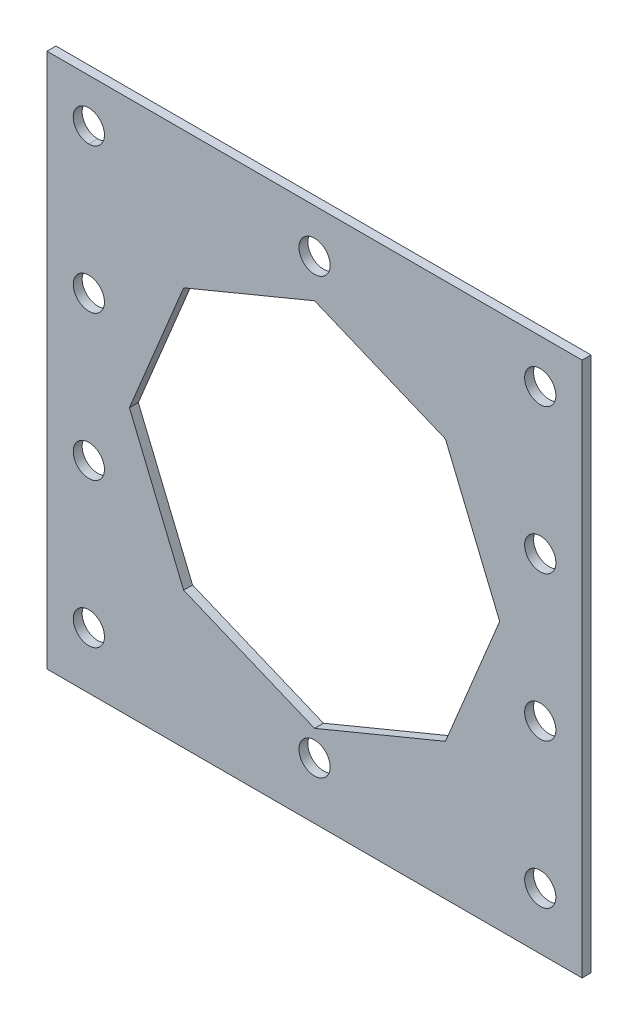
ISO-10303-21;
HEADER;
FILE_DESCRIPTION(('STEP AP214'),'2;1');
FILE_NAME('part.step','',(''),(''),'','','');
FILE_SCHEMA(('AUTOMOTIVE_DESIGN { 1 0 10303 214 1 1 1 1 }'));
ENDSEC;
DATA;
#1=APPLICATION_CONTEXT('core data for automotive mechanical design processes');
#2=APPLICATION_PROTOCOL_DEFINITION('international standard','automotive_design',2000,#1);
#3=PRODUCT_CONTEXT('',#1,'mechanical');
#4=PRODUCT('Part','Part','',(#3));
#5=PRODUCT_RELATED_PRODUCT_CATEGORY('part','',(#4));
#6=PRODUCT_DEFINITION_FORMATION('','',#4);
#7=PRODUCT_DEFINITION_CONTEXT('part definition',#1,'design');
#8=PRODUCT_DEFINITION('design','',#6,#7);
#9=PRODUCT_DEFINITION_SHAPE('','',#8);
#10=(LENGTH_UNIT() NAMED_UNIT(*) SI_UNIT(.MILLI.,.METRE.));
#11=(NAMED_UNIT(*) PLANE_ANGLE_UNIT() SI_UNIT($,.RADIAN.));
#12=(NAMED_UNIT(*) SI_UNIT($,.STERADIAN.) SOLID_ANGLE_UNIT());
#13=UNCERTAINTY_MEASURE_WITH_UNIT(LENGTH_MEASURE(1.E-05),#10,'distance_accuracy_value','');
#14=(GEOMETRIC_REPRESENTATION_CONTEXT(3) GLOBAL_UNCERTAINTY_ASSIGNED_CONTEXT((#13)) GLOBAL_UNIT_ASSIGNED_CONTEXT((#10,
#11,#12)) REPRESENTATION_CONTEXT('',''));
#15=CARTESIAN_POINT('',(0.,0.,0.));
#16=DIRECTION('',(0.,0.,1.));
#17=DIRECTION('',(1.,0.,0.));
#18=AXIS2_PLACEMENT_3D('',#15,#16,#17);
#19=CARTESIAN_POINT('',(-58.8904715737066,203.889838323353,10.));
#20=DIRECTION('',(0.,0.,-1.));
#21=DIRECTION('',(-1.,0.,0.));
#22=AXIS2_PLACEMENT_3D('',#19,#20,#21);
#23=CYLINDRICAL_SURFACE('',#22,17.5);
#24=CARTESIAN_POINT('',(-58.8904715737066,203.889838323353,0.));
#25=DIRECTION('',(0.,0.,1.));
#26=DIRECTION('',(1.,0.,0.));
#27=AXIS2_PLACEMENT_3D('',#24,#25,#26);
#28=CIRCLE('',#27,17.5);
#29=CARTESIAN_POINT('',(-58.892471573828,186.389838437639,0.));
#30=VERTEX_POINT('',#29);
#31=CARTESIAN_POINT('',(-58.892471573828,221.389838209068,0.));
#32=VERTEX_POINT('',#31);
#33=EDGE_CURVE('E264',#30,#32,#28,.T.);
#34=ORIENTED_EDGE('',*,*,#33,.F.);
#35=DIRECTION('',(0.,0.,-1.));
#36=VECTOR('',#35,1.);
#37=CARTESIAN_POINT('',(-58.892471573828,186.389838437639,10.));
#38=LINE('',#37,#36);
#39=CARTESIAN_POINT('',(-58.892471573828,186.389838437639,10.));
#40=VERTEX_POINT('',#39);
#41=EDGE_CURVE('E11',#40,#30,#38,.T.);
#42=ORIENTED_EDGE('',*,*,#41,.F.);
#43=CARTESIAN_POINT('',(-58.8904715737066,203.889838323353,10.));
#44=DIRECTION('',(0.,0.,1.));
#45=DIRECTION('',(1.,0.,0.));
#46=AXIS2_PLACEMENT_3D('',#43,#44,#45);
#47=CIRCLE('',#46,17.5);
#48=CARTESIAN_POINT('',(-58.892471573828,221.389838209068,10.));
#49=VERTEX_POINT('',#48);
#50=EDGE_CURVE('E200',#40,#49,#47,.T.);
#51=ORIENTED_EDGE('',*,*,#50,.T.);
#52=DIRECTION('',(0.,0.,-1.));
#53=VECTOR('',#52,1.);
#54=CARTESIAN_POINT('',(-58.892471573828,221.389838209068,10.));
#55=LINE('',#54,#53);
#56=EDGE_CURVE('E45',#49,#32,#55,.T.);
#57=ORIENTED_EDGE('',*,*,#56,.T.);
#58=EDGE_LOOP('',(#34,#42,#51,#57));
#59=FACE_BOUND('',#58,.T.);
#60=ADVANCED_FACE('F35',(#59),#23,.F.);
#61=CARTESIAN_POINT('',(494.179528426293,0.,10.));
#62=DIRECTION('',(1.,0.,0.));
#63=DIRECTION('',(0.,0.,-1.));
#64=AXIS2_PLACEMENT_3D('',#61,#62,#63);
#65=PLANE('',#64);
#66=DIRECTION('',(0.,-1.,0.));
#67=VECTOR('',#66,1.);
#68=CARTESIAN_POINT('',(494.179528426293,0.,0.));
#69=LINE('',#68,#67);
#70=CARTESIAN_POINT('',(494.179528426293,253.070838323353,0.));
#71=VERTEX_POINT('',#70);
#72=CARTESIAN_POINT('',(494.179528426293,-346.929161676647,0.));
#73=VERTEX_POINT('',#72);
#74=EDGE_CURVE('E234',#71,#73,#69,.T.);
#75=ORIENTED_EDGE('',*,*,#74,.F.);
#76=DIRECTION('',(0.,0.,-1.));
#77=VECTOR('',#76,1.);
#78=CARTESIAN_POINT('',(494.179528426293,253.070838323353,10.));
#79=LINE('',#78,#77);
#80=CARTESIAN_POINT('',(494.179528426293,253.070838323353,10.));
#81=VERTEX_POINT('',#80);
#82=EDGE_CURVE('E169',#81,#71,#79,.T.);
#83=ORIENTED_EDGE('',*,*,#82,.F.);
#84=DIRECTION('',(0.,-1.,0.));
#85=VECTOR('',#84,1.);
#86=CARTESIAN_POINT('',(494.179528426293,0.,10.));
#87=LINE('',#86,#85);
#88=CARTESIAN_POINT('',(494.179528426293,-346.929161676647,10.));
#89=VERTEX_POINT('',#88);
#90=EDGE_CURVE('E150',#81,#89,#87,.T.);
#91=ORIENTED_EDGE('',*,*,#90,.T.);
#92=DIRECTION('',(0.,0.,-1.));
#93=VECTOR('',#92,1.);
#94=CARTESIAN_POINT('',(494.179528426293,-346.929161676647,10.));
#95=LINE('',#94,#93);
#96=EDGE_CURVE('E160',#89,#73,#95,.T.);
#97=ORIENTED_EDGE('',*,*,#96,.T.);
#98=EDGE_LOOP('',(#75,#83,#91,#97));
#99=FACE_BOUND('',#98,.T.);
#100=ADVANCED_FACE('F168',(#99),#65,.T.);
#101=CARTESIAN_POINT('',(0.,253.070838323353,10.));
#102=DIRECTION('',(0.,1.,0.));
#103=DIRECTION('',(0.,0.,1.));
#104=AXIS2_PLACEMENT_3D('',#101,#102,#103);
#105=PLANE('',#104);
#106=DIRECTION('',(1.,0.,0.));
#107=VECTOR('',#106,1.);
#108=CARTESIAN_POINT('',(0.,253.070838323353,0.));
#109=LINE('',#108,#107);
#110=CARTESIAN_POINT('',(-105.820471573707,253.070838323353,0.));
#111=VERTEX_POINT('',#110);
#112=EDGE_CURVE('E236',#111,#71,#109,.T.);
#113=ORIENTED_EDGE('',*,*,#112,.F.);
#114=DIRECTION('',(0.,0.,-1.));
#115=VECTOR('',#114,1.);
#116=CARTESIAN_POINT('',(-105.820471573707,253.070838323353,10.));
#117=LINE('',#116,#115);
#118=CARTESIAN_POINT('',(-105.820471573707,253.070838323353,10.));
#119=VERTEX_POINT('',#118);
#120=EDGE_CURVE('E272',#119,#111,#117,.T.);
#121=ORIENTED_EDGE('',*,*,#120,.F.);
#122=DIRECTION('',(1.,0.,0.));
#123=VECTOR('',#122,1.);
#124=CARTESIAN_POINT('',(0.,253.070838323353,10.));
#125=LINE('',#124,#123);
#126=EDGE_CURVE('E170',#119,#81,#125,.T.);
#127=ORIENTED_EDGE('',*,*,#126,.T.);
#128=ORIENTED_EDGE('',*,*,#82,.T.);
#129=EDGE_LOOP('',(#113,#121,#127,#128));
#130=FACE_BOUND('',#129,.T.);
#131=ADVANCED_FACE('F363',(#130),#105,.T.);
#132=CARTESIAN_POINT('',(-105.820471573707,0.,10.));
#133=DIRECTION('',(1.,0.,0.));
#134=DIRECTION('',(0.,1.,0.));
#135=AXIS2_PLACEMENT_3D('',#132,#133,#134);
#136=PLANE('',#135);
#137=DIRECTION('',(0.,-1.,0.));
#138=VECTOR('',#137,1.);
#139=CARTESIAN_POINT('',(-105.820471573707,0.,0.));
#140=LINE('',#139,#138);
#141=CARTESIAN_POINT('',(-105.820471573707,-346.929161676647,0.));
#142=VERTEX_POINT('',#141);
#143=EDGE_CURVE('E239',#111,#142,#140,.T.);
#144=ORIENTED_EDGE('',*,*,#143,.T.);
#145=DIRECTION('',(0.,0.,-1.));
#146=VECTOR('',#145,1.);
#147=CARTESIAN_POINT('',(-105.820471573707,-346.929161676647,10.));
#148=LINE('',#147,#146);
#149=CARTESIAN_POINT('',(-105.820471573707,-346.929161676647,10.));
#150=VERTEX_POINT('',#149);
#151=EDGE_CURVE('E166',#150,#142,#148,.T.);
#152=ORIENTED_EDGE('',*,*,#151,.F.);
#153=DIRECTION('',(0.,-1.,0.));
#154=VECTOR('',#153,1.);
#155=CARTESIAN_POINT('',(-105.820471573707,0.,10.));
#156=LINE('',#155,#154);
#157=EDGE_CURVE('E153',#119,#150,#156,.T.);
#158=ORIENTED_EDGE('',*,*,#157,.F.);
#159=ORIENTED_EDGE('',*,*,#120,.T.);
#160=EDGE_LOOP('',(#144,#152,#158,#159));
#161=FACE_BOUND('',#160,.T.);
#162=ADVANCED_FACE('F396',(#161),#136,.F.);
#163=CARTESIAN_POINT('',(85.2344314709598,205.774120438351,10.));
#164=DIRECTION('',(-0.38268343236509,-0.923879532511287,0.));
#165=DIRECTION('',(0.923879532511287,-0.38268343236509,0.));
#166=AXIS2_PLACEMENT_3D('',#163,#164,#165);
#167=PLANE('',#166);
#168=DIRECTION('',(-0.923879532511287,0.38268343236509,0.));
#169=VECTOR('',#168,1.);
#170=CARTESIAN_POINT('',(85.2344314709598,205.774120438351,0.));
#171=LINE('',#170,#169);
#172=CARTESIAN_POINT('',(340.958452716714,99.849762613774,0.));
#173=VERTEX_POINT('',#172);
#174=CARTESIAN_POINT('',(194.179528426293,160.6475837254,0.));
#175=VERTEX_POINT('',#174);
#176=EDGE_CURVE('E210',#173,#175,#171,.T.);
#177=ORIENTED_EDGE('',*,*,#176,.F.);
#178=DIRECTION('',(0.,0.,-1.));
#179=VECTOR('',#178,1.);
#180=CARTESIAN_POINT('',(340.958452716714,99.849762613774,10.));
#181=LINE('',#180,#179);
#182=CARTESIAN_POINT('',(340.958452716714,99.849762613774,10.));
#183=VERTEX_POINT('',#182);
#184=EDGE_CURVE('E39',#183,#173,#181,.T.);
#185=ORIENTED_EDGE('',*,*,#184,.F.);
#186=DIRECTION('',(-0.923879532511287,0.38268343236509,0.));
#187=VECTOR('',#186,1.);
#188=CARTESIAN_POINT('',(85.2344314709598,205.774120438351,10.));
#189=LINE('',#188,#187);
#190=CARTESIAN_POINT('',(194.179528426293,160.6475837254,10.));
#191=VERTEX_POINT('',#190);
#192=EDGE_CURVE('E330',#183,#191,#189,.T.);
#193=ORIENTED_EDGE('',*,*,#192,.T.);
#194=DIRECTION('',(0.,0.,-1.));
#195=VECTOR('',#194,1.);
#196=CARTESIAN_POINT('',(194.179528426293,160.6475837254,10.));
#197=LINE('',#196,#195);
#198=EDGE_CURVE('E203',#191,#175,#197,.T.);
#199=ORIENTED_EDGE('',*,*,#198,.T.);
#200=EDGE_LOOP('',(#177,#185,#193,#199));
#201=FACE_BOUND('',#200,.T.);
#202=ADVANCED_FACE('F295',(#201),#167,.T.);
#203=CARTESIAN_POINT('',(326.328465489821,135.169676194284,10.));
#204=DIRECTION('',(-0.923879532511287,-0.38268343236509,0.));
#205=DIRECTION('',(0.38268343236509,-0.923879532511287,0.));
#206=AXIS2_PLACEMENT_3D('',#203,#204,#205);
#207=PLANE('',#206);
#208=DIRECTION('',(-0.38268343236509,0.923879532511287,0.));
#209=VECTOR('',#208,1.);
#210=CARTESIAN_POINT('',(326.328465489821,135.169676194284,0.));
#211=LINE('',#210,#209);
#212=CARTESIAN_POINT('',(401.75627382834,-46.9291616766467,0.));
#213=VERTEX_POINT('',#212);
#214=EDGE_CURVE('E213',#213,#173,#211,.T.);
#215=ORIENTED_EDGE('',*,*,#214,.F.);
#216=DIRECTION('',(0.,0.,-1.));
#217=VECTOR('',#216,1.);
#218=CARTESIAN_POINT('',(401.75627382834,-46.9291616766467,10.));
#219=LINE('',#218,#217);
#220=CARTESIAN_POINT('',(401.75627382834,-46.9291616766467,10.));
#221=VERTEX_POINT('',#220);
#222=EDGE_CURVE('E285',#221,#213,#219,.T.);
#223=ORIENTED_EDGE('',*,*,#222,.F.);
#224=DIRECTION('',(-0.38268343236509,0.923879532511287,0.));
#225=VECTOR('',#224,1.);
#226=CARTESIAN_POINT('',(326.328465489821,135.169676194284,10.));
#227=LINE('',#226,#225);
#228=EDGE_CURVE('E294',#221,#183,#227,.T.);
#229=ORIENTED_EDGE('',*,*,#228,.T.);
#230=ORIENTED_EDGE('',*,*,#184,.T.);
#231=EDGE_LOOP('',(#215,#223,#229,#230));
#232=FACE_BOUND('',#231,.T.);
#233=ADVANCED_FACE('F292',(#232),#207,.T.);
#234=CARTESIAN_POINT('',(359.512393946778,-148.914909413974,10.));
#235=DIRECTION('',(-0.923879532511287,0.38268343236509,0.));
#236=DIRECTION('',(-0.38268343236509,-0.923879532511287,0.));
#237=AXIS2_PLACEMENT_3D('',#234,#235,#236);
#238=PLANE('',#237);
#239=DIRECTION('',(0.38268343236509,0.923879532511287,0.));
#240=VECTOR('',#239,1.);
#241=CARTESIAN_POINT('',(359.512393946778,-148.914909413974,0.));
#242=LINE('',#241,#240);
#243=CARTESIAN_POINT('',(340.958452716714,-193.708085967068,0.));
#244=VERTEX_POINT('',#243);
#245=EDGE_CURVE('E216',#244,#213,#242,.T.);
#246=ORIENTED_EDGE('',*,*,#245,.F.);
#247=DIRECTION('',(0.,0.,-1.));
#248=VECTOR('',#247,1.);
#249=CARTESIAN_POINT('',(340.958452716714,-193.708085967068,10.));
#250=LINE('',#249,#248);
#251=CARTESIAN_POINT('',(340.958452716714,-193.708085967068,10.));
#252=VERTEX_POINT('',#251);
#253=EDGE_CURVE('E284',#252,#244,#250,.T.);
#254=ORIENTED_EDGE('',*,*,#253,.F.);
#255=DIRECTION('',(0.38268343236509,0.923879532511287,0.));
#256=VECTOR('',#255,1.);
#257=CARTESIAN_POINT('',(359.512393946778,-148.914909413974,10.));
#258=LINE('',#257,#256);
#259=EDGE_CURVE('E303',#252,#221,#258,.T.);
#260=ORIENTED_EDGE('',*,*,#259,.T.);
#261=ORIENTED_EDGE('',*,*,#222,.T.);
#262=EDGE_LOOP('',(#246,#254,#260,#261));
#263=FACE_BOUND('',#262,.T.);
#264=ADVANCED_FACE('F301',(#263),#238,.T.);
#265=CARTESIAN_POINT('',(118.418359927917,-285.887210571955,10.));
#266=DIRECTION('',(-0.38268343236509,0.923879532511287,0.));
#267=DIRECTION('',(-0.923879532511287,-0.38268343236509,0.));
#268=AXIS2_PLACEMENT_3D('',#265,#266,#267);
#269=PLANE('',#268);
#270=DIRECTION('',(0.923879532511287,0.38268343236509,0.));
#271=VECTOR('',#270,1.);
#272=CARTESIAN_POINT('',(118.418359927917,-285.887210571955,0.));
#273=LINE('',#272,#271);
#274=CARTESIAN_POINT('',(194.179528426294,-254.505907078694,0.));
#275=VERTEX_POINT('',#274);
#276=EDGE_CURVE('E219',#275,#244,#273,.T.);
#277=ORIENTED_EDGE('',*,*,#276,.F.);
#278=DIRECTION('',(0.,0.,-1.));
#279=VECTOR('',#278,1.);
#280=CARTESIAN_POINT('',(194.179528426294,-254.505907078694,10.));
#281=LINE('',#280,#279);
#282=CARTESIAN_POINT('',(194.179528426294,-254.505907078694,10.));
#283=VERTEX_POINT('',#282);
#284=EDGE_CURVE('E282',#283,#275,#281,.T.);
#285=ORIENTED_EDGE('',*,*,#284,.F.);
#286=DIRECTION('',(0.923879532511287,0.38268343236509,0.));
#287=VECTOR('',#286,1.);
#288=CARTESIAN_POINT('',(118.418359927917,-285.887210571955,10.));
#289=LINE('',#288,#287);
#290=EDGE_CURVE('E309',#283,#252,#289,.T.);
#291=ORIENTED_EDGE('',*,*,#290,.T.);
#292=ORIENTED_EDGE('',*,*,#253,.T.);
#293=EDGE_LOOP('',(#277,#285,#291,#292));
#294=FACE_BOUND('',#293,.T.);
#295=ADVANCED_FACE('F312',(#294),#269,.T.);
#296=CARTESIAN_POINT('',(-61.5444928194611,-148.581549254117,10.));
#297=DIRECTION('',(0.38268343236509,0.923879532511287,0.));
#298=DIRECTION('',(-0.923879532511287,0.38268343236509,0.));
#299=AXIS2_PLACEMENT_3D('',#296,#297,#298);
#300=PLANE('',#299);
#301=DIRECTION('',(0.923879532511287,-0.38268343236509,0.));
#302=VECTOR('',#301,1.);
#303=CARTESIAN_POINT('',(-61.5444928194611,-148.581549254117,0.));
#304=LINE('',#303,#302);
#305=CARTESIAN_POINT('',(47.4006041358727,-193.708085967068,0.));
#306=VERTEX_POINT('',#305);
#307=EDGE_CURVE('E222',#306,#275,#304,.T.);
#308=ORIENTED_EDGE('',*,*,#307,.F.);
#309=DIRECTION('',(0.,0.,-1.));
#310=VECTOR('',#309,1.);
#311=CARTESIAN_POINT('',(47.4006041358727,-193.708085967068,10.));
#312=LINE('',#311,#310);
#313=CARTESIAN_POINT('',(47.4006041358727,-193.708085967068,10.));
#314=VERTEX_POINT('',#313);
#315=EDGE_CURVE('E280',#314,#306,#312,.T.);
#316=ORIENTED_EDGE('',*,*,#315,.F.);
#317=DIRECTION('',(0.923879532511287,-0.38268343236509,0.));
#318=VECTOR('',#317,1.);
#319=CARTESIAN_POINT('',(-61.5444928194611,-148.581549254117,10.));
#320=LINE('',#319,#318);
#321=EDGE_CURVE('E313',#314,#283,#320,.T.);
#322=ORIENTED_EDGE('',*,*,#321,.T.);
#323=ORIENTED_EDGE('',*,*,#284,.T.);
#324=EDGE_LOOP('',(#308,#316,#322,#323));
#325=FACE_BOUND('',#324,.T.);
#326=ADVANCED_FACE('F410',(#325),#300,.T.);
#327=CARTESIAN_POINT('',(-28.0272042026464,-11.6092480961364,10.));
#328=DIRECTION('',(0.923879532511287,0.38268343236509,0.));
#329=DIRECTION('',(-0.38268343236509,0.923879532511287,0.));
#330=AXIS2_PLACEMENT_3D('',#327,#328,#329);
#331=PLANE('',#330);
#332=DIRECTION('',(0.38268343236509,-0.923879532511287,0.));
#333=VECTOR('',#332,1.);
#334=CARTESIAN_POINT('',(-28.0272042026464,-11.6092480961364,0.));
#335=LINE('',#334,#333);
#336=CARTESIAN_POINT('',(-13.3972169757533,-46.9291616766468,0.));
#337=VERTEX_POINT('',#336);
#338=EDGE_CURVE('E225',#337,#306,#335,.T.);
#339=ORIENTED_EDGE('',*,*,#338,.F.);
#340=DIRECTION('',(0.,0.,-1.));
#341=VECTOR('',#340,1.);
#342=CARTESIAN_POINT('',(-13.3972169757533,-46.9291616766468,10.));
#343=LINE('',#342,#341);
#344=CARTESIAN_POINT('',(-13.3972169757533,-46.9291616766468,10.));
#345=VERTEX_POINT('',#344);
#346=EDGE_CURVE('E278',#345,#337,#343,.T.);
#347=ORIENTED_EDGE('',*,*,#346,.F.);
#348=DIRECTION('',(0.38268343236509,-0.923879532511287,0.));
#349=VECTOR('',#348,1.);
#350=CARTESIAN_POINT('',(-28.0272042026464,-11.6092480961364,10.));
#351=LINE('',#350,#349);
#352=EDGE_CURVE('E315',#345,#314,#351,.T.);
#353=ORIENTED_EDGE('',*,*,#352,.T.);
#354=ORIENTED_EDGE('',*,*,#315,.T.);
#355=EDGE_LOOP('',(#339,#347,#353,#354));
#356=FACE_BOUND('',#355,.T.);
#357=ADVANCED_FACE('F407',(#356),#331,.T.);
#358=CARTESIAN_POINT('',(5.15672425431036,-2.13598512355363,10.));
#359=DIRECTION('',(0.923879532511287,-0.38268343236509,0.));
#360=DIRECTION('',(0.38268343236509,0.923879532511287,0.));
#361=AXIS2_PLACEMENT_3D('',#358,#359,#360);
#362=PLANE('',#361);
#363=DIRECTION('',(-0.38268343236509,-0.923879532511287,0.));
#364=VECTOR('',#363,1.);
#365=CARTESIAN_POINT('',(5.15672425431036,-2.13598512355363,0.));
#366=LINE('',#365,#364);
#367=CARTESIAN_POINT('',(47.4006041358726,99.849762613774,0.));
#368=VERTEX_POINT('',#367);
#369=EDGE_CURVE('E228',#368,#337,#366,.T.);
#370=ORIENTED_EDGE('',*,*,#369,.F.);
#371=DIRECTION('',(0.,0.,-1.));
#372=VECTOR('',#371,1.);
#373=CARTESIAN_POINT('',(47.4006041358726,99.849762613774,10.));
#374=LINE('',#373,#372);
#375=CARTESIAN_POINT('',(47.4006041358726,99.849762613774,10.));
#376=VERTEX_POINT('',#375);
#377=EDGE_CURVE('E276',#376,#368,#374,.T.);
#378=ORIENTED_EDGE('',*,*,#377,.F.);
#379=DIRECTION('',(-0.38268343236509,-0.923879532511287,0.));
#380=VECTOR('',#379,1.);
#381=CARTESIAN_POINT('',(5.15672425431036,-2.13598512355363,10.));
#382=LINE('',#381,#380);
#383=EDGE_CURVE('E175',#376,#345,#382,.T.);
#384=ORIENTED_EDGE('',*,*,#383,.T.);
#385=ORIENTED_EDGE('',*,*,#346,.T.);
#386=EDGE_LOOP('',(#370,#378,#384,#385));
#387=FACE_BOUND('',#386,.T.);
#388=ADVANCED_FACE('F324',(#387),#362,.T.);
#389=CARTESIAN_POINT('',(-58.8944715737082,41.48950499002,10.));
#390=DIRECTION('',(0.,0.,-1.));
#391=DIRECTION('',(-1.,0.,0.));
#392=AXIS2_PLACEMENT_3D('',#389,#390,#391);
#393=CYLINDRICAL_SURFACE('',#392,17.5);
#394=CARTESIAN_POINT('',(-58.8944715737082,41.48950499002,10.));
#395=DIRECTION('',(0.,0.,1.));
#396=DIRECTION('',(1.,0.,0.));
#397=AXIS2_PLACEMENT_3D('',#394,#395,#396);
#398=CIRCLE('',#397,17.5);
#399=CARTESIAN_POINT('',(-41.3944715737082,41.48950499002,10.));
#400=VERTEX_POINT('',#399);
#401=EDGE_CURVE('E197',#400,#400,#398,.F.);
#402=ORIENTED_EDGE('',*,*,#401,.F.);
#403=EDGE_LOOP('',(#402));
#404=FACE_BOUND('',#403,.T.);
#405=CARTESIAN_POINT('',(-58.8944715737082,41.48950499002,0.));
#406=DIRECTION('',(0.,0.,1.));
#407=DIRECTION('',(1.,0.,0.));
#408=AXIS2_PLACEMENT_3D('',#405,#406,#407);
#409=CIRCLE('',#408,17.5);
#410=CARTESIAN_POINT('',(-41.3944715737082,41.48950499002,0.));
#411=VERTEX_POINT('',#410);
#412=EDGE_CURVE('E261',#411,#411,#409,.F.);
#413=ORIENTED_EDGE('',*,*,#412,.T.);
#414=EDGE_LOOP('',(#413));
#415=FACE_BOUND('',#414,.T.);
#416=ADVANCED_FACE('F366',(#404,#415),#393,.F.);
#417=CARTESIAN_POINT('',(-58.8944715737063,-283.311161676647,10.));
#418=DIRECTION('',(0.,0.,-1.));
#419=DIRECTION('',(-1.,0.,0.));
#420=AXIS2_PLACEMENT_3D('',#417,#418,#419);
#421=CYLINDRICAL_SURFACE('',#420,17.5);
#422=CARTESIAN_POINT('',(-58.8944715737063,-283.311161676647,10.));
#423=DIRECTION('',(0.,0.,1.));
#424=DIRECTION('',(1.,0.,0.));
#425=AXIS2_PLACEMENT_3D('',#422,#423,#424);
#426=CIRCLE('',#425,17.5);
#427=CARTESIAN_POINT('',(-41.3944715737063,-283.311161676647,10.));
#428=VERTEX_POINT('',#427);
#429=EDGE_CURVE('E194',#428,#428,#426,.F.);
#430=ORIENTED_EDGE('',*,*,#429,.F.);
#431=EDGE_LOOP('',(#430));
#432=FACE_BOUND('',#431,.T.);
#433=CARTESIAN_POINT('',(-58.8944715737063,-283.311161676647,0.));
#434=DIRECTION('',(0.,0.,1.));
#435=DIRECTION('',(1.,0.,0.));
#436=AXIS2_PLACEMENT_3D('',#433,#434,#435);
#437=CIRCLE('',#436,17.5);
#438=CARTESIAN_POINT('',(-41.3944715737063,-283.311161676647,0.));
#439=VERTEX_POINT('',#438);
#440=EDGE_CURVE('E258',#439,#439,#437,.F.);
#441=ORIENTED_EDGE('',*,*,#440,.T.);
#442=EDGE_LOOP('',(#441));
#443=FACE_BOUND('',#442,.T.);
#444=ADVANCED_FACE('F369',(#432,#443),#421,.F.);
#445=CARTESIAN_POINT('',(447.253528426293,-283.311161676647,10.));
#446=DIRECTION('',(0.,0.,-1.));
#447=DIRECTION('',(-1.,0.,0.));
#448=AXIS2_PLACEMENT_3D('',#445,#446,#447);
#449=CYLINDRICAL_SURFACE('',#448,17.5);
#450=CARTESIAN_POINT('',(447.253528426293,-283.311161676647,10.));
#451=DIRECTION('',(0.,0.,1.));
#452=DIRECTION('',(1.,0.,0.));
#453=AXIS2_PLACEMENT_3D('',#450,#451,#452);
#454=CIRCLE('',#453,17.5);
#455=CARTESIAN_POINT('',(464.753528426293,-283.311161676647,10.));
#456=VERTEX_POINT('',#455);
#457=EDGE_CURVE('E191',#456,#456,#454,.T.);
#458=ORIENTED_EDGE('',*,*,#457,.T.);
#459=EDGE_LOOP('',(#458));
#460=FACE_BOUND('',#459,.T.);
#461=CARTESIAN_POINT('',(447.253528426293,-283.311161676647,0.));
#462=DIRECTION('',(0.,0.,1.));
#463=DIRECTION('',(1.,0.,0.));
#464=AXIS2_PLACEMENT_3D('',#461,#462,#463);
#465=CIRCLE('',#464,17.5);
#466=CARTESIAN_POINT('',(464.753528426293,-283.311161676647,0.));
#467=VERTEX_POINT('',#466);
#468=EDGE_CURVE('E255',#467,#467,#465,.T.);
#469=ORIENTED_EDGE('',*,*,#468,.F.);
#470=EDGE_LOOP('',(#469));
#471=FACE_BOUND('',#470,.T.);
#472=ADVANCED_FACE('F373',(#460,#471),#449,.F.);
#473=CARTESIAN_POINT('',(447.253528426297,-120.910828343313,10.));
#474=DIRECTION('',(0.,0.,-1.));
#475=DIRECTION('',(-1.,0.,0.));
#476=AXIS2_PLACEMENT_3D('',#473,#474,#475);
#477=CYLINDRICAL_SURFACE('',#476,17.5);
#478=CARTESIAN_POINT('',(447.253528426297,-120.910828343313,10.));
#479=DIRECTION('',(0.,0.,1.));
#480=DIRECTION('',(1.,0.,0.));
#481=AXIS2_PLACEMENT_3D('',#478,#479,#480);
#482=CIRCLE('',#481,17.5);
#483=CARTESIAN_POINT('',(464.753528426297,-120.910828343313,10.));
#484=VERTEX_POINT('',#483);
#485=EDGE_CURVE('E188',#484,#484,#482,.T.);
#486=ORIENTED_EDGE('',*,*,#485,.T.);
#487=EDGE_LOOP('',(#486));
#488=FACE_BOUND('',#487,.T.);
#489=CARTESIAN_POINT('',(447.253528426297,-120.910828343313,0.));
#490=DIRECTION('',(0.,0.,1.));
#491=DIRECTION('',(1.,0.,0.));
#492=AXIS2_PLACEMENT_3D('',#489,#490,#491);
#493=CIRCLE('',#492,17.5);
#494=CARTESIAN_POINT('',(464.753528426297,-120.910828343313,0.));
#495=VERTEX_POINT('',#494);
#496=EDGE_CURVE('E252',#495,#495,#493,.T.);
#497=ORIENTED_EDGE('',*,*,#496,.F.);
#498=EDGE_LOOP('',(#497));
#499=FACE_BOUND('',#498,.T.);
#500=ADVANCED_FACE('F377',(#488,#499),#477,.F.);
#501=CARTESIAN_POINT('',(447.253528426295,41.48950499002,10.));
#502=DIRECTION('',(0.,0.,-1.));
#503=DIRECTION('',(-1.,0.,0.));
#504=AXIS2_PLACEMENT_3D('',#501,#502,#503);
#505=CYLINDRICAL_SURFACE('',#504,17.5);
#506=CARTESIAN_POINT('',(447.253528426295,41.48950499002,10.));
#507=DIRECTION('',(0.,0.,1.));
#508=DIRECTION('',(1.,0.,0.));
#509=AXIS2_PLACEMENT_3D('',#506,#507,#508);
#510=CIRCLE('',#509,17.5);
#511=CARTESIAN_POINT('',(464.753528426295,41.48950499002,10.));
#512=VERTEX_POINT('',#511);
#513=EDGE_CURVE('E185',#512,#512,#510,.T.);
#514=ORIENTED_EDGE('',*,*,#513,.T.);
#515=EDGE_LOOP('',(#514));
#516=FACE_BOUND('',#515,.T.);
#517=CARTESIAN_POINT('',(447.253528426295,41.48950499002,0.));
#518=DIRECTION('',(0.,0.,1.));
#519=DIRECTION('',(1.,0.,0.));
#520=AXIS2_PLACEMENT_3D('',#517,#518,#519);
#521=CIRCLE('',#520,17.5);
#522=CARTESIAN_POINT('',(464.753528426295,41.48950499002,0.));
#523=VERTEX_POINT('',#522);
#524=EDGE_CURVE('E249',#523,#523,#521,.T.);
#525=ORIENTED_EDGE('',*,*,#524,.F.);
#526=EDGE_LOOP('',(#525));
#527=FACE_BOUND('',#526,.T.);
#528=ADVANCED_FACE('F381',(#516,#527),#505,.F.);
#529=CARTESIAN_POINT('',(194.181528426293,203.889838323352,10.));
#530=DIRECTION('',(0.,0.,-1.));
#531=DIRECTION('',(-1.,0.,0.));
#532=AXIS2_PLACEMENT_3D('',#529,#530,#531);
#533=CYLINDRICAL_SURFACE('',#532,17.5);
#534=CARTESIAN_POINT('',(194.181528426293,203.889838323352,10.));
#535=DIRECTION('',(0.,0.,1.));
#536=DIRECTION('',(1.,0.,0.));
#537=AXIS2_PLACEMENT_3D('',#534,#535,#536);
#538=CIRCLE('',#537,17.5);
#539=CARTESIAN_POINT('',(211.681528426293,203.889838323352,10.));
#540=VERTEX_POINT('',#539);
#541=EDGE_CURVE('E182',#540,#540,#538,.T.);
#542=ORIENTED_EDGE('',*,*,#541,.T.);
#543=EDGE_LOOP('',(#542));
#544=FACE_BOUND('',#543,.T.);
#545=CARTESIAN_POINT('',(194.181528426293,203.889838323352,0.));
#546=DIRECTION('',(0.,0.,1.));
#547=DIRECTION('',(1.,0.,0.));
#548=AXIS2_PLACEMENT_3D('',#545,#546,#547);
#549=CIRCLE('',#548,17.5);
#550=CARTESIAN_POINT('',(211.681528426293,203.889838323352,0.));
#551=VERTEX_POINT('',#550);
#552=EDGE_CURVE('E246',#551,#551,#549,.T.);
#553=ORIENTED_EDGE('',*,*,#552,.F.);
#554=EDGE_LOOP('',(#553));
#555=FACE_BOUND('',#554,.T.);
#556=ADVANCED_FACE('F385',(#544,#555),#533,.F.);
#557=CARTESIAN_POINT('',(447.253528426293,203.889838323353,10.));
#558=DIRECTION('',(0.,0.,-1.));
#559=DIRECTION('',(-1.,0.,0.));
#560=AXIS2_PLACEMENT_3D('',#557,#558,#559);
#561=CYLINDRICAL_SURFACE('',#560,17.5);
#562=CARTESIAN_POINT('',(447.253528426293,203.889838323353,10.));
#563=DIRECTION('',(0.,0.,1.));
#564=DIRECTION('',(1.,0.,0.));
#565=AXIS2_PLACEMENT_3D('',#562,#563,#564);
#566=CIRCLE('',#565,17.5);
#567=CARTESIAN_POINT('',(464.753528426293,203.889838323353,10.));
#568=VERTEX_POINT('',#567);
#569=EDGE_CURVE('E157',#568,#568,#566,.T.);
#570=ORIENTED_EDGE('',*,*,#569,.T.);
#571=EDGE_LOOP('',(#570));
#572=FACE_BOUND('',#571,.T.);
#573=CARTESIAN_POINT('',(447.253528426293,203.889838323353,0.));
#574=DIRECTION('',(0.,0.,1.));
#575=DIRECTION('',(1.,0.,0.));
#576=AXIS2_PLACEMENT_3D('',#573,#574,#575);
#577=CIRCLE('',#576,17.5);
#578=CARTESIAN_POINT('',(464.753528426293,203.889838323353,0.));
#579=VERTEX_POINT('',#578);
#580=EDGE_CURVE('E243',#579,#579,#577,.T.);
#581=ORIENTED_EDGE('',*,*,#580,.F.);
#582=EDGE_LOOP('',(#581));
#583=FACE_BOUND('',#582,.T.);
#584=ADVANCED_FACE('F389',(#572,#583),#561,.F.);
#585=CARTESIAN_POINT('',(0.,-346.929161676647,10.));
#586=DIRECTION('',(0.,1.,0.));
#587=DIRECTION('',(0.,0.,1.));
#588=AXIS2_PLACEMENT_3D('',#585,#586,#587);
#589=PLANE('',#588);
#590=DIRECTION('',(1.,0.,0.));
#591=VECTOR('',#590,1.);
#592=CARTESIAN_POINT('',(0.,-346.929161676647,0.));
#593=LINE('',#592,#591);
#594=EDGE_CURVE('E162',#142,#73,#593,.T.);
#595=ORIENTED_EDGE('',*,*,#594,.T.);
#596=ORIENTED_EDGE('',*,*,#96,.F.);
#597=DIRECTION('',(1.,0.,0.));
#598=VECTOR('',#597,1.);
#599=CARTESIAN_POINT('',(0.,-346.929161676647,10.));
#600=LINE('',#599,#598);
#601=EDGE_CURVE('E144',#150,#89,#600,.T.);
#602=ORIENTED_EDGE('',*,*,#601,.F.);
#603=ORIENTED_EDGE('',*,*,#151,.T.);
#604=EDGE_LOOP('',(#595,#596,#602,#603));
#605=FACE_BOUND('',#604,.T.);
#606=ADVANCED_FACE('F161',(#605),#589,.F.);
#607=CARTESIAN_POINT('',(-28.3605643625043,68.468459120513,10.));
#608=DIRECTION('',(0.38268343236509,-0.923879532511287,0.));
#609=DIRECTION('',(0.923879532511287,0.38268343236509,0.));
#610=AXIS2_PLACEMENT_3D('',#607,#608,#609);
#611=PLANE('',#610);
#612=DIRECTION('',(-0.923879532511287,-0.38268343236509,0.));
#613=VECTOR('',#612,1.);
#614=CARTESIAN_POINT('',(-28.3605643625043,68.468459120513,0.));
#615=LINE('',#614,#613);
#616=EDGE_CURVE('E231',#175,#368,#615,.T.);
#617=ORIENTED_EDGE('',*,*,#616,.F.);
#618=ORIENTED_EDGE('',*,*,#198,.F.);
#619=DIRECTION('',(-0.923879532511287,-0.38268343236509,0.));
#620=VECTOR('',#619,1.);
#621=CARTESIAN_POINT('',(-28.3605643625043,68.468459120513,10.));
#622=LINE('',#621,#620);
#623=EDGE_CURVE('E171',#191,#376,#622,.T.);
#624=ORIENTED_EDGE('',*,*,#623,.T.);
#625=ORIENTED_EDGE('',*,*,#377,.T.);
#626=EDGE_LOOP('',(#617,#618,#624,#625));
#627=FACE_BOUND('',#626,.T.);
#628=ADVANCED_FACE('F329',(#627),#611,.T.);
#629=CARTESIAN_POINT('',(-58.8944715737099,-120.910828343313,10.));
#630=DIRECTION('',(0.,0.,-1.));
#631=DIRECTION('',(-1.,0.,0.));
#632=AXIS2_PLACEMENT_3D('',#629,#630,#631);
#633=CYLINDRICAL_SURFACE('',#632,17.5);
#634=CARTESIAN_POINT('',(-58.8944715737099,-120.910828343313,10.));
#635=DIRECTION('',(0.,0.,1.));
#636=DIRECTION('',(1.,0.,0.));
#637=AXIS2_PLACEMENT_3D('',#634,#635,#636);
#638=CIRCLE('',#637,17.5);
#639=CARTESIAN_POINT('',(-41.3944715737099,-120.910828343313,10.));
#640=VERTEX_POINT('',#639);
#641=EDGE_CURVE('E331',#640,#640,#638,.F.);
#642=ORIENTED_EDGE('',*,*,#641,.F.);
#643=EDGE_LOOP('',(#642));
#644=FACE_BOUND('',#643,.T.);
#645=CARTESIAN_POINT('',(-58.8944715737099,-120.910828343313,0.));
#646=DIRECTION('',(0.,0.,1.));
#647=DIRECTION('',(1.,0.,0.));
#648=AXIS2_PLACEMENT_3D('',#645,#646,#647);
#649=CIRCLE('',#648,17.5);
#650=CARTESIAN_POINT('',(-41.3944715737099,-120.910828343313,0.));
#651=VERTEX_POINT('',#650);
#652=EDGE_CURVE('E207',#651,#651,#649,.F.);
#653=ORIENTED_EDGE('',*,*,#652,.T.);
#654=EDGE_LOOP('',(#653));
#655=FACE_BOUND('',#654,.T.);
#656=ADVANCED_FACE('F347',(#644,#655),#633,.F.);
#657=CARTESIAN_POINT('',(194.179528426293,-283.311161676647,10.));
#658=DIRECTION('',(0.,0.,-1.));
#659=DIRECTION('',(-1.,0.,0.));
#660=AXIS2_PLACEMENT_3D('',#657,#658,#659);
#661=CYLINDRICAL_SURFACE('',#660,17.5);
#662=CARTESIAN_POINT('',(194.179528426293,-283.311161676647,10.));
#663=DIRECTION('',(0.,0.,1.));
#664=DIRECTION('',(1.,0.,0.));
#665=AXIS2_PLACEMENT_3D('',#662,#663,#664);
#666=CIRCLE('',#665,17.5);
#667=CARTESIAN_POINT('',(211.679528426293,-283.311161676647,10.));
#668=VERTEX_POINT('',#667);
#669=EDGE_CURVE('E269',#668,#668,#666,.T.);
#670=ORIENTED_EDGE('',*,*,#669,.T.);
#671=EDGE_LOOP('',(#670));
#672=FACE_BOUND('',#671,.T.);
#673=CARTESIAN_POINT('',(194.179528426293,-283.311161676647,0.));
#674=DIRECTION('',(0.,0.,1.));
#675=DIRECTION('',(1.,0.,0.));
#676=AXIS2_PLACEMENT_3D('',#673,#674,#675);
#677=CIRCLE('',#676,17.5);
#678=CARTESIAN_POINT('',(211.679528426293,-283.311161676647,0.));
#679=VERTEX_POINT('',#678);
#680=EDGE_CURVE('E204',#679,#679,#677,.T.);
#681=ORIENTED_EDGE('',*,*,#680,.F.);
#682=EDGE_LOOP('',(#681));
#683=FACE_BOUND('',#682,.T.);
#684=ADVANCED_FACE('F37',(#672,#683),#661,.F.);
#685=CARTESIAN_POINT('',(-58.8944715737065,203.889838323353,10.));
#686=DIRECTION('',(0.,0.,-1.));
#687=DIRECTION('',(-1.,0.,0.));
#688=AXIS2_PLACEMENT_3D('',#685,#686,#687);
#689=CYLINDRICAL_SURFACE('',#688,17.5);
#690=CARTESIAN_POINT('',(-58.8944715737065,203.889838323353,0.));
#691=DIRECTION('',(0.,0.,1.));
#692=DIRECTION('',(1.,0.,0.));
#693=AXIS2_PLACEMENT_3D('',#690,#691,#692);
#694=CIRCLE('',#693,17.5);
#695=EDGE_CURVE('E267',#30,#32,#694,.F.);
#696=ORIENTED_EDGE('',*,*,#695,.T.);
#697=ORIENTED_EDGE('',*,*,#56,.F.);
#698=CARTESIAN_POINT('',(-58.8944715737065,203.889838323353,10.));
#699=DIRECTION('',(0.,0.,1.));
#700=DIRECTION('',(1.,0.,0.));
#701=AXIS2_PLACEMENT_3D('',#698,#699,#700);
#702=CIRCLE('',#701,17.5);
#703=EDGE_CURVE('E53',#40,#49,#702,.F.);
#704=ORIENTED_EDGE('',*,*,#703,.F.);
#705=ORIENTED_EDGE('',*,*,#41,.T.);
#706=EDGE_LOOP('',(#696,#697,#704,#705));
#707=FACE_BOUND('',#706,.T.);
#708=ADVANCED_FACE('F343',(#707),#689,.F.);
#709=CARTESIAN_POINT('',(0.,0.,10.));
#710=DIRECTION('',(0.,0.,1.));
#711=DIRECTION('',(1.,0.,0.));
#712=AXIS2_PLACEMENT_3D('',#709,#710,#711);
#713=PLANE('',#712);
#714=ORIENTED_EDGE('',*,*,#669,.F.);
#715=EDGE_LOOP('',(#714));
#716=FACE_BOUND('',#715,.T.);
#717=ORIENTED_EDGE('',*,*,#641,.T.);
#718=EDGE_LOOP('',(#717));
#719=FACE_BOUND('',#718,.T.);
#720=ORIENTED_EDGE('',*,*,#192,.F.);
#721=ORIENTED_EDGE('',*,*,#228,.F.);
#722=ORIENTED_EDGE('',*,*,#259,.F.);
#723=ORIENTED_EDGE('',*,*,#290,.F.);
#724=ORIENTED_EDGE('',*,*,#321,.F.);
#725=ORIENTED_EDGE('',*,*,#352,.F.);
#726=ORIENTED_EDGE('',*,*,#383,.F.);
#727=ORIENTED_EDGE('',*,*,#623,.F.);
#728=EDGE_LOOP('',(#720,#721,#722,#723,#724,#725,#726,#727));
#729=FACE_BOUND('',#728,.T.);
#730=ORIENTED_EDGE('',*,*,#90,.F.);
#731=ORIENTED_EDGE('',*,*,#126,.F.);
#732=ORIENTED_EDGE('',*,*,#157,.T.);
#733=ORIENTED_EDGE('',*,*,#601,.T.);
#734=EDGE_LOOP('',(#730,#731,#732,#733));
#735=FACE_BOUND('',#734,.T.);
#736=ORIENTED_EDGE('',*,*,#569,.F.);
#737=EDGE_LOOP('',(#736));
#738=FACE_BOUND('',#737,.T.);
#739=ORIENTED_EDGE('',*,*,#541,.F.);
#740=EDGE_LOOP('',(#739));
#741=FACE_BOUND('',#740,.T.);
#742=ORIENTED_EDGE('',*,*,#513,.F.);
#743=EDGE_LOOP('',(#742));
#744=FACE_BOUND('',#743,.T.);
#745=ORIENTED_EDGE('',*,*,#485,.F.);
#746=EDGE_LOOP('',(#745));
#747=FACE_BOUND('',#746,.T.);
#748=ORIENTED_EDGE('',*,*,#457,.F.);
#749=EDGE_LOOP('',(#748));
#750=FACE_BOUND('',#749,.T.);
#751=ORIENTED_EDGE('',*,*,#429,.T.);
#752=EDGE_LOOP('',(#751));
#753=FACE_BOUND('',#752,.T.);
#754=ORIENTED_EDGE('',*,*,#401,.T.);
#755=EDGE_LOOP('',(#754));
#756=FACE_BOUND('',#755,.T.);
#757=ORIENTED_EDGE('',*,*,#50,.F.);
#758=ORIENTED_EDGE('',*,*,#703,.T.);
#759=EDGE_LOOP('',(#757,#758));
#760=FACE_BOUND('',#759,.T.);
#761=ADVANCED_FACE('F146',(#716,#719,#729,#735,#738,#741,#744,#747,#750,#753,#756,#760),#713,.T.);
#762=CARTESIAN_POINT('',(0.,0.,0.));
#763=DIRECTION('',(0.,0.,1.));
#764=DIRECTION('',(1.,0.,0.));
#765=AXIS2_PLACEMENT_3D('',#762,#763,#764);
#766=PLANE('',#765);
#767=ORIENTED_EDGE('',*,*,#680,.T.);
#768=EDGE_LOOP('',(#767));
#769=FACE_BOUND('',#768,.T.);
#770=ORIENTED_EDGE('',*,*,#652,.F.);
#771=EDGE_LOOP('',(#770));
#772=FACE_BOUND('',#771,.T.);
#773=ORIENTED_EDGE('',*,*,#176,.T.);
#774=ORIENTED_EDGE('',*,*,#616,.T.);
#775=ORIENTED_EDGE('',*,*,#369,.T.);
#776=ORIENTED_EDGE('',*,*,#338,.T.);
#777=ORIENTED_EDGE('',*,*,#307,.T.);
#778=ORIENTED_EDGE('',*,*,#276,.T.);
#779=ORIENTED_EDGE('',*,*,#245,.T.);
#780=ORIENTED_EDGE('',*,*,#214,.T.);
#781=EDGE_LOOP('',(#773,#774,#775,#776,#777,#778,#779,#780));
#782=FACE_BOUND('',#781,.T.);
#783=ORIENTED_EDGE('',*,*,#74,.T.);
#784=ORIENTED_EDGE('',*,*,#594,.F.);
#785=ORIENTED_EDGE('',*,*,#143,.F.);
#786=ORIENTED_EDGE('',*,*,#112,.T.);
#787=EDGE_LOOP('',(#783,#784,#785,#786));
#788=FACE_BOUND('',#787,.T.);
#789=ORIENTED_EDGE('',*,*,#580,.T.);
#790=EDGE_LOOP('',(#789));
#791=FACE_BOUND('',#790,.T.);
#792=ORIENTED_EDGE('',*,*,#552,.T.);
#793=EDGE_LOOP('',(#792));
#794=FACE_BOUND('',#793,.T.);
#795=ORIENTED_EDGE('',*,*,#524,.T.);
#796=EDGE_LOOP('',(#795));
#797=FACE_BOUND('',#796,.T.);
#798=ORIENTED_EDGE('',*,*,#496,.T.);
#799=EDGE_LOOP('',(#798));
#800=FACE_BOUND('',#799,.T.);
#801=ORIENTED_EDGE('',*,*,#468,.T.);
#802=EDGE_LOOP('',(#801));
#803=FACE_BOUND('',#802,.T.);
#804=ORIENTED_EDGE('',*,*,#440,.F.);
#805=EDGE_LOOP('',(#804));
#806=FACE_BOUND('',#805,.T.);
#807=ORIENTED_EDGE('',*,*,#412,.F.);
#808=EDGE_LOOP('',(#807));
#809=FACE_BOUND('',#808,.T.);
#810=ORIENTED_EDGE('',*,*,#33,.T.);
#811=ORIENTED_EDGE('',*,*,#695,.F.);
#812=EDGE_LOOP('',(#810,#811));
#813=FACE_BOUND('',#812,.T.);
#814=ADVANCED_FACE('F298',(#769,#772,#782,#788,#791,#794,#797,#800,#803,#806,#809,#813),#766,.F.);
#815=CLOSED_SHELL('',(#60,#100,#131,#162,#202,#233,#264,#295,#326,#357,#388,#416,#444,#472,#500,
#528,#556,#584,#606,#628,#656,#684,#708,#761,#814));
#816=MANIFOLD_SOLID_BREP('B2',#815);
#817=ADVANCED_BREP_SHAPE_REPRESENTATION('',(#18,#816),#14);
#818=SHAPE_DEFINITION_REPRESENTATION(#9,#817);
ENDSEC;
END-ISO-10303-21;
